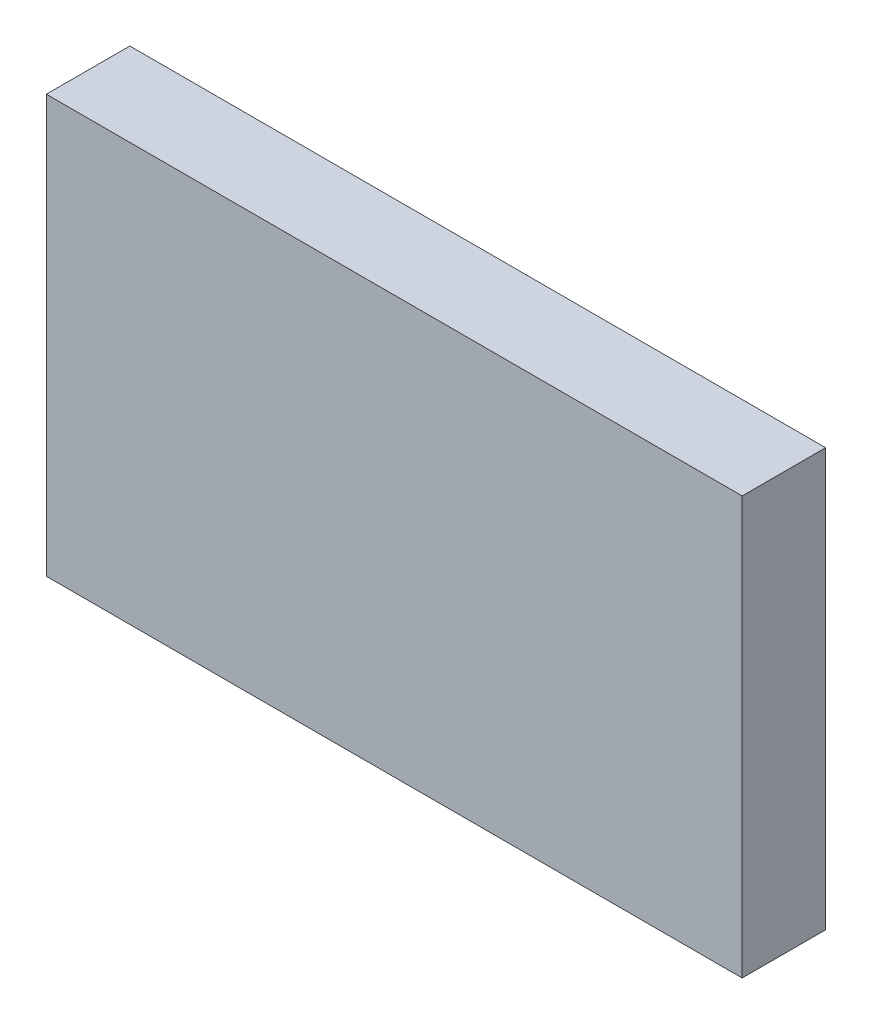
ISO-10303-21;
HEADER;
FILE_DESCRIPTION(('STEP AP214'),'2;1');
FILE_NAME('part.step','',(''),(''),'','','');
FILE_SCHEMA(('AUTOMOTIVE_DESIGN { 1 0 10303 214 1 1 1 1 }'));
ENDSEC;
DATA;
#1=APPLICATION_CONTEXT('core data for automotive mechanical design processes');
#2=APPLICATION_PROTOCOL_DEFINITION('international standard','automotive_design',2000,#1);
#3=PRODUCT_CONTEXT('',#1,'mechanical');
#4=PRODUCT('Part','Part','',(#3));
#5=PRODUCT_RELATED_PRODUCT_CATEGORY('part','',(#4));
#6=PRODUCT_DEFINITION_FORMATION('','',#4);
#7=PRODUCT_DEFINITION_CONTEXT('part definition',#1,'design');
#8=PRODUCT_DEFINITION('design','',#6,#7);
#9=PRODUCT_DEFINITION_SHAPE('','',#8);
#10=(LENGTH_UNIT() NAMED_UNIT(*) SI_UNIT(.MILLI.,.METRE.));
#11=(NAMED_UNIT(*) PLANE_ANGLE_UNIT() SI_UNIT($,.RADIAN.));
#12=(NAMED_UNIT(*) SI_UNIT($,.STERADIAN.) SOLID_ANGLE_UNIT());
#13=UNCERTAINTY_MEASURE_WITH_UNIT(LENGTH_MEASURE(1.E-05),#10,'distance_accuracy_value','');
#14=(GEOMETRIC_REPRESENTATION_CONTEXT(3) GLOBAL_UNCERTAINTY_ASSIGNED_CONTEXT((#13)) GLOBAL_UNIT_ASSIGNED_CONTEXT((#10,
#11,#12)) REPRESENTATION_CONTEXT('',''));
#15=CARTESIAN_POINT('',(0.,0.,0.));
#16=DIRECTION('',(0.,0.,1.));
#17=DIRECTION('',(1.,0.,0.));
#18=AXIS2_PLACEMENT_3D('',#15,#16,#17);
#19=CARTESIAN_POINT('',(64.6035075358139,7.04478011911902,6.));
#20=DIRECTION('',(0.,-1.,0.));
#21=DIRECTION('',(0.,0.,-1.));
#22=AXIS2_PLACEMENT_3D('',#19,#20,#21);
#23=PLANE('',#22);
#24=DIRECTION('',(-1.,0.,0.));
#25=VECTOR('',#24,1.);
#26=CARTESIAN_POINT('',(64.6035075358139,7.04478011911902,0.));
#27=LINE('',#26,#25);
#28=CARTESIAN_POINT('',(64.6035075358139,7.04478011911902,0.));
#29=VERTEX_POINT('',#28);
#30=CARTESIAN_POINT('',(14.6035075358139,7.04478011911902,0.));
#31=VERTEX_POINT('',#30);
#32=EDGE_CURVE('E109',#29,#31,#27,.T.);
#33=ORIENTED_EDGE('',*,*,#32,.F.);
#34=DIRECTION('',(0.,0.,-1.));
#35=VECTOR('',#34,1.);
#36=CARTESIAN_POINT('',(64.6035075358139,7.04478011911902,6.));
#37=LINE('',#36,#35);
#38=CARTESIAN_POINT('',(64.6035075358139,7.04478011911902,6.));
#39=VERTEX_POINT('',#38);
#40=EDGE_CURVE('E11',#39,#29,#37,.T.);
#41=ORIENTED_EDGE('',*,*,#40,.F.);
#42=DIRECTION('',(-1.,0.,0.));
#43=VECTOR('',#42,1.);
#44=CARTESIAN_POINT('',(64.6035075358139,7.04478011911902,6.));
#45=LINE('',#44,#43);
#46=CARTESIAN_POINT('',(14.6035075358139,7.04478011911902,6.));
#47=VERTEX_POINT('',#46);
#48=EDGE_CURVE('E101',#39,#47,#45,.T.);
#49=ORIENTED_EDGE('',*,*,#48,.T.);
#50=DIRECTION('',(0.,0.,-1.));
#51=VECTOR('',#50,1.);
#52=CARTESIAN_POINT('',(14.6035075358139,7.04478011911902,6.));
#53=LINE('',#52,#51);
#54=EDGE_CURVE('E42',#47,#31,#53,.T.);
#55=ORIENTED_EDGE('',*,*,#54,.T.);
#56=EDGE_LOOP('',(#33,#41,#49,#55));
#57=FACE_BOUND('',#56,.T.);
#58=ADVANCED_FACE('F39',(#57),#23,.T.);
#59=CARTESIAN_POINT('',(64.6035075358139,37.044780119119,6.));
#60=DIRECTION('',(1.,0.,0.));
#61=DIRECTION('',(0.,0.,-1.));
#62=AXIS2_PLACEMENT_3D('',#59,#60,#61);
#63=PLANE('',#62);
#64=DIRECTION('',(0.,-1.,0.));
#65=VECTOR('',#64,1.);
#66=CARTESIAN_POINT('',(64.6035075358139,37.044780119119,0.));
#67=LINE('',#66,#65);
#68=CARTESIAN_POINT('',(64.6035075358139,37.044780119119,0.));
#69=VERTEX_POINT('',#68);
#70=EDGE_CURVE('E104',#69,#29,#67,.T.);
#71=ORIENTED_EDGE('',*,*,#70,.F.);
#72=DIRECTION('',(0.,0.,-1.));
#73=VECTOR('',#72,1.);
#74=CARTESIAN_POINT('',(64.6035075358139,37.044780119119,6.));
#75=LINE('',#74,#73);
#76=CARTESIAN_POINT('',(64.6035075358139,37.044780119119,6.));
#77=VERTEX_POINT('',#76);
#78=EDGE_CURVE('E49',#77,#69,#75,.T.);
#79=ORIENTED_EDGE('',*,*,#78,.F.);
#80=DIRECTION('',(0.,-1.,0.));
#81=VECTOR('',#80,1.);
#82=CARTESIAN_POINT('',(64.6035075358139,37.044780119119,6.));
#83=LINE('',#82,#81);
#84=EDGE_CURVE('E96',#77,#39,#83,.T.);
#85=ORIENTED_EDGE('',*,*,#84,.T.);
#86=ORIENTED_EDGE('',*,*,#40,.T.);
#87=EDGE_LOOP('',(#71,#79,#85,#86));
#88=FACE_BOUND('',#87,.T.);
#89=ADVANCED_FACE('F125',(#88),#63,.T.);
#90=CARTESIAN_POINT('',(14.6035075358139,37.044780119119,6.));
#91=DIRECTION('',(0.,1.,0.));
#92=DIRECTION('',(0.,0.,1.));
#93=AXIS2_PLACEMENT_3D('',#90,#91,#92);
#94=PLANE('',#93);
#95=DIRECTION('',(1.,0.,0.));
#96=VECTOR('',#95,1.);
#97=CARTESIAN_POINT('',(14.6035075358139,37.044780119119,0.));
#98=LINE('',#97,#96);
#99=CARTESIAN_POINT('',(14.6035075358139,37.044780119119,0.));
#100=VERTEX_POINT('',#99);
#101=EDGE_CURVE('E90',#100,#69,#98,.T.);
#102=ORIENTED_EDGE('',*,*,#101,.F.);
#103=DIRECTION('',(0.,0.,-1.));
#104=VECTOR('',#103,1.);
#105=CARTESIAN_POINT('',(14.6035075358139,37.044780119119,6.));
#106=LINE('',#105,#104);
#107=CARTESIAN_POINT('',(14.6035075358139,37.044780119119,6.));
#108=VERTEX_POINT('',#107);
#109=EDGE_CURVE('E85',#108,#100,#106,.T.);
#110=ORIENTED_EDGE('',*,*,#109,.F.);
#111=DIRECTION('',(1.,0.,0.));
#112=VECTOR('',#111,1.);
#113=CARTESIAN_POINT('',(14.6035075358139,37.044780119119,6.));
#114=LINE('',#113,#112);
#115=EDGE_CURVE('E88',#108,#77,#114,.T.);
#116=ORIENTED_EDGE('',*,*,#115,.T.);
#117=ORIENTED_EDGE('',*,*,#78,.T.);
#118=EDGE_LOOP('',(#102,#110,#116,#117));
#119=FACE_BOUND('',#118,.T.);
#120=ADVANCED_FACE('F87',(#119),#94,.T.);
#121=CARTESIAN_POINT('',(14.6035075358139,7.04478011911902,6.));
#122=DIRECTION('',(-1.,0.,0.));
#123=DIRECTION('',(0.,0.,1.));
#124=AXIS2_PLACEMENT_3D('',#121,#122,#123);
#125=PLANE('',#124);
#126=DIRECTION('',(0.,1.,0.));
#127=VECTOR('',#126,1.);
#128=CARTESIAN_POINT('',(14.6035075358139,7.04478011911902,0.));
#129=LINE('',#128,#127);
#130=EDGE_CURVE('E113',#31,#100,#129,.T.);
#131=ORIENTED_EDGE('',*,*,#130,.F.);
#132=ORIENTED_EDGE('',*,*,#54,.F.);
#133=DIRECTION('',(0.,1.,0.));
#134=VECTOR('',#133,1.);
#135=CARTESIAN_POINT('',(14.6035075358139,7.04478011911902,6.));
#136=LINE('',#135,#134);
#137=EDGE_CURVE('E95',#47,#108,#136,.T.);
#138=ORIENTED_EDGE('',*,*,#137,.T.);
#139=ORIENTED_EDGE('',*,*,#109,.T.);
#140=EDGE_LOOP('',(#131,#132,#138,#139));
#141=FACE_BOUND('',#140,.T.);
#142=ADVANCED_FACE('F99',(#141),#125,.T.);
#143=CARTESIAN_POINT('',(0.,0.,6.));
#144=DIRECTION('',(0.,0.,-1.));
#145=DIRECTION('',(-1.,0.,0.));
#146=AXIS2_PLACEMENT_3D('',#143,#144,#145);
#147=PLANE('',#146);
#148=ORIENTED_EDGE('',*,*,#48,.F.);
#149=ORIENTED_EDGE('',*,*,#84,.F.);
#150=ORIENTED_EDGE('',*,*,#115,.F.);
#151=ORIENTED_EDGE('',*,*,#137,.F.);
#152=EDGE_LOOP('',(#148,#149,#150,#151));
#153=FACE_BOUND('',#152,.T.);
#154=ADVANCED_FACE('F94',(#153),#147,.F.);
#155=CARTESIAN_POINT('',(0.,0.,0.));
#156=DIRECTION('',(0.,0.,-1.));
#157=DIRECTION('',(-1.,0.,0.));
#158=AXIS2_PLACEMENT_3D('',#155,#156,#157);
#159=PLANE('',#158);
#160=ORIENTED_EDGE('',*,*,#32,.T.);
#161=ORIENTED_EDGE('',*,*,#130,.T.);
#162=ORIENTED_EDGE('',*,*,#101,.T.);
#163=ORIENTED_EDGE('',*,*,#70,.T.);
#164=EDGE_LOOP('',(#160,#161,#162,#163));
#165=FACE_BOUND('',#164,.T.);
#166=ADVANCED_FACE('F124',(#165),#159,.T.);
#167=CLOSED_SHELL('',(#58,#89,#120,#142,#154,#166));
#168=MANIFOLD_SOLID_BREP('B2',#167);
#169=ADVANCED_BREP_SHAPE_REPRESENTATION('',(#18,#168),#14);
#170=SHAPE_DEFINITION_REPRESENTATION(#9,#169);
ENDSEC;
END-ISO-10303-21;
